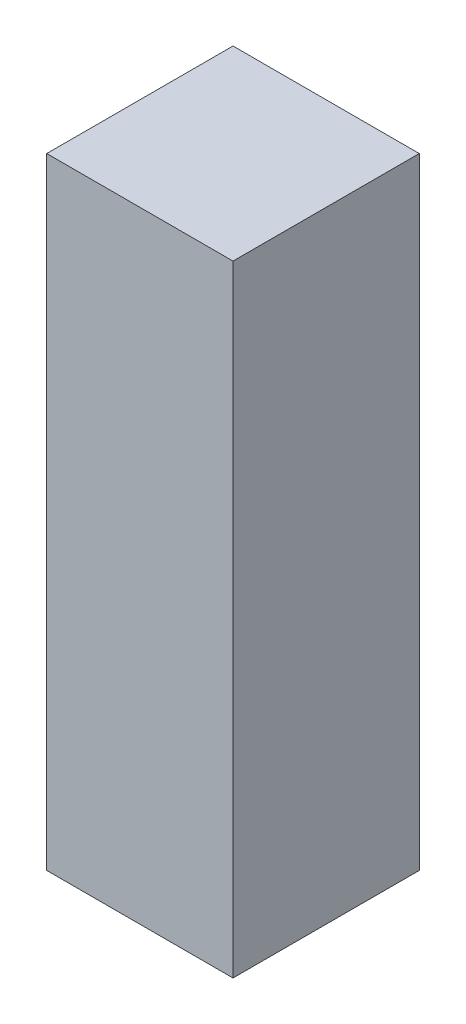
ISO-10303-21;
HEADER;
FILE_DESCRIPTION(('STEP AP214'),'2;1');
FILE_NAME('part.step','',(''),(''),'','','');
FILE_SCHEMA(('AUTOMOTIVE_DESIGN { 1 0 10303 214 1 1 1 1 }'));
ENDSEC;
DATA;
#1=APPLICATION_CONTEXT('core data for automotive mechanical design processes');
#2=APPLICATION_PROTOCOL_DEFINITION('international standard','automotive_design',2000,#1);
#3=PRODUCT_CONTEXT('',#1,'mechanical');
#4=PRODUCT('Part','Part','',(#3));
#5=PRODUCT_RELATED_PRODUCT_CATEGORY('part','',(#4));
#6=PRODUCT_DEFINITION_FORMATION('','',#4);
#7=PRODUCT_DEFINITION_CONTEXT('part definition',#1,'design');
#8=PRODUCT_DEFINITION('design','',#6,#7);
#9=PRODUCT_DEFINITION_SHAPE('','',#8);
#10=(LENGTH_UNIT() NAMED_UNIT(*) SI_UNIT(.MILLI.,.METRE.));
#11=(NAMED_UNIT(*) PLANE_ANGLE_UNIT() SI_UNIT($,.RADIAN.));
#12=(NAMED_UNIT(*) SI_UNIT($,.STERADIAN.) SOLID_ANGLE_UNIT());
#13=UNCERTAINTY_MEASURE_WITH_UNIT(LENGTH_MEASURE(1.E-05),#10,'distance_accuracy_value','');
#14=(GEOMETRIC_REPRESENTATION_CONTEXT(3) GLOBAL_UNCERTAINTY_ASSIGNED_CONTEXT((#13)) GLOBAL_UNIT_ASSIGNED_CONTEXT((#10,
#11,#12)) REPRESENTATION_CONTEXT('',''));
#15=CARTESIAN_POINT('',(0.,0.,0.));
#16=DIRECTION('',(0.,0.,1.));
#17=DIRECTION('',(1.,0.,0.));
#18=AXIS2_PLACEMENT_3D('',#15,#16,#17);
#19=CARTESIAN_POINT('',(15.,-50.,15.));
#20=DIRECTION('',(-1.,0.,0.));
#21=DIRECTION('',(0.,0.,1.));
#22=AXIS2_PLACEMENT_3D('',#19,#20,#21);
#23=PLANE('',#22);
#24=DIRECTION('',(0.,1.,0.));
#25=VECTOR('',#24,1.);
#26=CARTESIAN_POINT('',(15.,-50.,-15.));
#27=LINE('',#26,#25);
#28=CARTESIAN_POINT('',(15.,-50.,-15.));
#29=VERTEX_POINT('',#28);
#30=CARTESIAN_POINT('',(15.,50.,-15.));
#31=VERTEX_POINT('',#30);
#32=EDGE_CURVE('E102',#29,#31,#27,.T.);
#33=ORIENTED_EDGE('',*,*,#32,.T.);
#34=DIRECTION('',(0.,0.,-1.));
#35=VECTOR('',#34,1.);
#36=CARTESIAN_POINT('',(15.,50.,15.));
#37=LINE('',#36,#35);
#38=CARTESIAN_POINT('',(15.,50.,15.));
#39=VERTEX_POINT('',#38);
#40=EDGE_CURVE('E11',#39,#31,#37,.T.);
#41=ORIENTED_EDGE('',*,*,#40,.F.);
#42=DIRECTION('',(0.,1.,0.));
#43=VECTOR('',#42,1.);
#44=CARTESIAN_POINT('',(15.,-50.,15.));
#45=LINE('',#44,#43);
#46=CARTESIAN_POINT('',(15.,-50.,15.));
#47=VERTEX_POINT('',#46);
#48=EDGE_CURVE('E90',#47,#39,#45,.T.);
#49=ORIENTED_EDGE('',*,*,#48,.F.);
#50=DIRECTION('',(0.,0.,-1.));
#51=VECTOR('',#50,1.);
#52=CARTESIAN_POINT('',(15.,-50.,15.));
#53=LINE('',#52,#51);
#54=EDGE_CURVE('E98',#47,#29,#53,.T.);
#55=ORIENTED_EDGE('',*,*,#54,.T.);
#56=EDGE_LOOP('',(#33,#41,#49,#55));
#57=FACE_BOUND('',#56,.T.);
#58=ADVANCED_FACE('F39',(#57),#23,.F.);
#59=CARTESIAN_POINT('',(-15.,50.,15.));
#60=DIRECTION('',(0.,-1.,0.));
#61=DIRECTION('',(0.,0.,-1.));
#62=AXIS2_PLACEMENT_3D('',#59,#60,#61);
#63=PLANE('',#62);
#64=DIRECTION('',(-1.,0.,0.));
#65=VECTOR('',#64,1.);
#66=CARTESIAN_POINT('',(-15.,50.,-15.));
#67=LINE('',#66,#65);
#68=CARTESIAN_POINT('',(-15.,50.,-15.));
#69=VERTEX_POINT('',#68);
#70=EDGE_CURVE('E94',#31,#69,#67,.T.);
#71=ORIENTED_EDGE('',*,*,#70,.T.);
#72=DIRECTION('',(0.,0.,-1.));
#73=VECTOR('',#72,1.);
#74=CARTESIAN_POINT('',(-15.,50.,15.));
#75=LINE('',#74,#73);
#76=CARTESIAN_POINT('',(-15.,50.,15.));
#77=VERTEX_POINT('',#76);
#78=EDGE_CURVE('E47',#77,#69,#75,.T.);
#79=ORIENTED_EDGE('',*,*,#78,.F.);
#80=DIRECTION('',(-1.,0.,0.));
#81=VECTOR('',#80,1.);
#82=CARTESIAN_POINT('',(-15.,50.,15.));
#83=LINE('',#82,#81);
#84=EDGE_CURVE('E85',#39,#77,#83,.T.);
#85=ORIENTED_EDGE('',*,*,#84,.F.);
#86=ORIENTED_EDGE('',*,*,#40,.T.);
#87=EDGE_LOOP('',(#71,#79,#85,#86));
#88=FACE_BOUND('',#87,.T.);
#89=ADVANCED_FACE('F93',(#88),#63,.F.);
#90=CARTESIAN_POINT('',(-15.,-50.,15.));
#91=DIRECTION('',(1.,0.,0.));
#92=DIRECTION('',(0.,0.,-1.));
#93=AXIS2_PLACEMENT_3D('',#90,#91,#92);
#94=PLANE('',#93);
#95=DIRECTION('',(0.,-1.,0.));
#96=VECTOR('',#95,1.);
#97=CARTESIAN_POINT('',(-15.,-50.,-15.));
#98=LINE('',#97,#96);
#99=CARTESIAN_POINT('',(-15.,-50.,-15.));
#100=VERTEX_POINT('',#99);
#101=EDGE_CURVE('E72',#69,#100,#98,.T.);
#102=ORIENTED_EDGE('',*,*,#101,.T.);
#103=DIRECTION('',(0.,0.,-1.));
#104=VECTOR('',#103,1.);
#105=CARTESIAN_POINT('',(-15.,-50.,15.));
#106=LINE('',#105,#104);
#107=CARTESIAN_POINT('',(-15.,-50.,15.));
#108=VERTEX_POINT('',#107);
#109=EDGE_CURVE('E95',#108,#100,#106,.T.);
#110=ORIENTED_EDGE('',*,*,#109,.F.);
#111=DIRECTION('',(0.,-1.,0.));
#112=VECTOR('',#111,1.);
#113=CARTESIAN_POINT('',(-15.,-50.,15.));
#114=LINE('',#113,#112);
#115=EDGE_CURVE('E88',#77,#108,#114,.T.);
#116=ORIENTED_EDGE('',*,*,#115,.F.);
#117=ORIENTED_EDGE('',*,*,#78,.T.);
#118=EDGE_LOOP('',(#102,#110,#116,#117));
#119=FACE_BOUND('',#118,.T.);
#120=ADVANCED_FACE('F96',(#119),#94,.F.);
#121=CARTESIAN_POINT('',(-15.,-50.,15.));
#122=DIRECTION('',(0.,1.,0.));
#123=DIRECTION('',(0.,0.,1.));
#124=AXIS2_PLACEMENT_3D('',#121,#122,#123);
#125=PLANE('',#124);
#126=DIRECTION('',(1.,0.,0.));
#127=VECTOR('',#126,1.);
#128=CARTESIAN_POINT('',(-15.,-50.,-15.));
#129=LINE('',#128,#127);
#130=EDGE_CURVE('E78',#100,#29,#129,.T.);
#131=ORIENTED_EDGE('',*,*,#130,.T.);
#132=ORIENTED_EDGE('',*,*,#54,.F.);
#133=DIRECTION('',(1.,0.,0.));
#134=VECTOR('',#133,1.);
#135=CARTESIAN_POINT('',(-15.,-50.,15.));
#136=LINE('',#135,#134);
#137=EDGE_CURVE('E55',#108,#47,#136,.T.);
#138=ORIENTED_EDGE('',*,*,#137,.F.);
#139=ORIENTED_EDGE('',*,*,#109,.T.);
#140=EDGE_LOOP('',(#131,#132,#138,#139));
#141=FACE_BOUND('',#140,.T.);
#142=ADVANCED_FACE('F109',(#141),#125,.F.);
#143=CARTESIAN_POINT('',(0.,0.,15.));
#144=DIRECTION('',(0.,0.,-1.));
#145=DIRECTION('',(-1.,0.,0.));
#146=AXIS2_PLACEMENT_3D('',#143,#144,#145);
#147=PLANE('',#146);
#148=ORIENTED_EDGE('',*,*,#48,.T.);
#149=ORIENTED_EDGE('',*,*,#84,.T.);
#150=ORIENTED_EDGE('',*,*,#115,.T.);
#151=ORIENTED_EDGE('',*,*,#137,.T.);
#152=EDGE_LOOP('',(#148,#149,#150,#151));
#153=FACE_BOUND('',#152,.T.);
#154=ADVANCED_FACE('F86',(#153),#147,.F.);
#155=CARTESIAN_POINT('',(0.,0.,-15.));
#156=DIRECTION('',(0.,0.,-1.));
#157=DIRECTION('',(-1.,0.,0.));
#158=AXIS2_PLACEMENT_3D('',#155,#156,#157);
#159=PLANE('',#158);
#160=ORIENTED_EDGE('',*,*,#32,.F.);
#161=ORIENTED_EDGE('',*,*,#130,.F.);
#162=ORIENTED_EDGE('',*,*,#101,.F.);
#163=ORIENTED_EDGE('',*,*,#70,.F.);
#164=EDGE_LOOP('',(#160,#161,#162,#163));
#165=FACE_BOUND('',#164,.T.);
#166=ADVANCED_FACE('F112',(#165),#159,.T.);
#167=CLOSED_SHELL('',(#58,#89,#120,#142,#154,#166));
#168=MANIFOLD_SOLID_BREP('B2',#167);
#169=ADVANCED_BREP_SHAPE_REPRESENTATION('',(#18,#168),#14);
#170=SHAPE_DEFINITION_REPRESENTATION(#9,#169);
ENDSEC;
END-ISO-10303-21;
